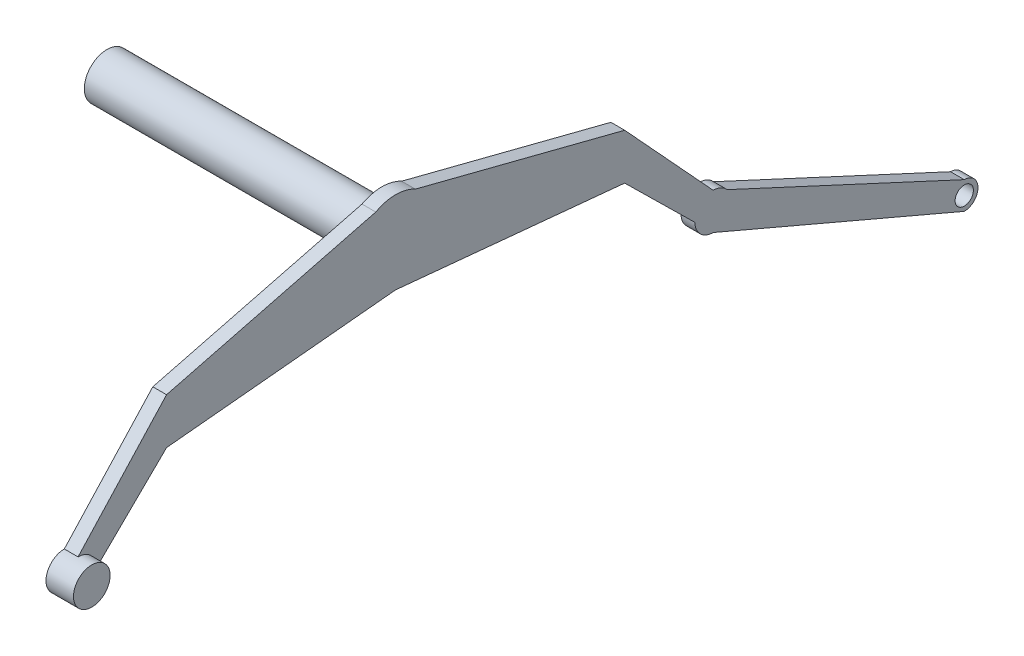
ISO-10303-21;
HEADER;
FILE_DESCRIPTION(('STEP AP214'),'2;1');
FILE_NAME('part.step','',(''),(''),'','','');
FILE_SCHEMA(('AUTOMOTIVE_DESIGN { 1 0 10303 214 1 1 1 1 }'));
ENDSEC;
DATA;
#1=APPLICATION_CONTEXT('core data for automotive mechanical design processes');
#2=APPLICATION_PROTOCOL_DEFINITION('international standard','automotive_design',2000,#1);
#3=PRODUCT_CONTEXT('',#1,'mechanical');
#4=PRODUCT('Part','Part','',(#3));
#5=PRODUCT_RELATED_PRODUCT_CATEGORY('part','',(#4));
#6=PRODUCT_DEFINITION_FORMATION('','',#4);
#7=PRODUCT_DEFINITION_CONTEXT('part definition',#1,'design');
#8=PRODUCT_DEFINITION('design','',#6,#7);
#9=PRODUCT_DEFINITION_SHAPE('','',#8);
#10=(LENGTH_UNIT() NAMED_UNIT(*) SI_UNIT(.MILLI.,.METRE.));
#11=(NAMED_UNIT(*) PLANE_ANGLE_UNIT() SI_UNIT($,.RADIAN.));
#12=(NAMED_UNIT(*) SI_UNIT($,.STERADIAN.) SOLID_ANGLE_UNIT());
#13=UNCERTAINTY_MEASURE_WITH_UNIT(LENGTH_MEASURE(1.E-05),#10,'distance_accuracy_value','');
#14=(GEOMETRIC_REPRESENTATION_CONTEXT(3) GLOBAL_UNCERTAINTY_ASSIGNED_CONTEXT((#13)) GLOBAL_UNIT_ASSIGNED_CONTEXT((#10,
#11,#12)) REPRESENTATION_CONTEXT('',''));
#15=CARTESIAN_POINT('',(0.,0.,0.));
#16=DIRECTION('',(0.,0.,1.));
#17=DIRECTION('',(1.,0.,0.));
#18=AXIS2_PLACEMENT_3D('',#15,#16,#17);
#19=CARTESIAN_POINT('',(30.,179.753290641171,176.832982389412));
#20=DIRECTION('',(0.,0.71287381552973,0.701292323594152));
#21=DIRECTION('',(0.,-0.701292323594152,0.71287381552973));
#22=AXIS2_PLACEMENT_3D('',#19,#20,#21);
#23=PLANE('',#22);
#24=DIRECTION('',(0.,0.701292323594152,-0.71287381552973));
#25=VECTOR('',#24,1.);
#26=CARTESIAN_POINT('',(0.,179.753290641171,176.832982389412));
#27=LINE('',#26,#25);
#28=CARTESIAN_POINT('',(0.,-288.818616503664,653.143120199633));
#29=VERTEX_POINT('',#28);
#30=CARTESIAN_POINT('',(0.,-138.163490354231,500.));
#31=VERTEX_POINT('',#30);
#32=EDGE_CURVE('E251',#29,#31,#27,.T.);
#33=ORIENTED_EDGE('',*,*,#32,.T.);
#34=DIRECTION('',(-1.,0.,0.));
#35=VECTOR('',#34,1.);
#36=CARTESIAN_POINT('',(30.,-138.163490354231,500.));
#37=LINE('',#36,#35);
#38=CARTESIAN_POINT('',(30.,-138.163490354231,500.));
#39=VERTEX_POINT('',#38);
#40=EDGE_CURVE('E417',#39,#31,#37,.T.);
#41=ORIENTED_EDGE('',*,*,#40,.F.);
#42=DIRECTION('',(0.,0.701292323594152,-0.71287381552973));
#43=VECTOR('',#42,1.);
#44=CARTESIAN_POINT('',(30.,179.753290641171,176.832982389412));
#45=LINE('',#44,#43);
#46=CARTESIAN_POINT('',(30.,-288.818616503664,653.143120199633));
#47=VERTEX_POINT('',#46);
#48=EDGE_CURVE('E377',#47,#39,#45,.T.);
#49=ORIENTED_EDGE('',*,*,#48,.F.);
#50=DIRECTION('',(-1.,0.,0.));
#51=VECTOR('',#50,1.);
#52=CARTESIAN_POINT('',(30.,-288.818616503664,653.143120199633));
#53=LINE('',#52,#51);
#54=EDGE_CURVE('E153',#47,#29,#53,.T.);
#55=ORIENTED_EDGE('',*,*,#54,.T.);
#56=EDGE_LOOP('',(#33,#41,#49,#55));
#57=FACE_BOUND('',#56,.T.);
#58=ADVANCED_FACE('F143',(#57),#23,.F.);
#59=CARTESIAN_POINT('',(30.,-89.1725777089985,-8.58972517269854));
#60=DIRECTION('',(0.,0.995392595405889,0.0958831633350092));
#61=DIRECTION('',(0.,-0.0958831633350092,0.995392595405889));
#62=AXIS2_PLACEMENT_3D('',#59,#60,#61);
#63=PLANE('',#62);
#64=DIRECTION('',(0.,0.0958831633350092,-0.995392595405889));
#65=VECTOR('',#64,1.);
#66=CARTESIAN_POINT('',(0.,-89.1725777089985,-8.58972517269854));
#67=LINE('',#66,#65);
#68=CARTESIAN_POINT('',(0.,-90.,0.));
#69=VERTEX_POINT('',#68);
#70=EDGE_CURVE('E396',#31,#69,#67,.T.);
#71=ORIENTED_EDGE('',*,*,#70,.T.);
#72=DIRECTION('',(-1.,0.,0.));
#73=VECTOR('',#72,1.);
#74=CARTESIAN_POINT('',(30.,-90.,0.));
#75=LINE('',#74,#73);
#76=CARTESIAN_POINT('',(30.,-90.,0.));
#77=VERTEX_POINT('',#76);
#78=EDGE_CURVE('E414',#77,#69,#75,.T.);
#79=ORIENTED_EDGE('',*,*,#78,.F.);
#80=DIRECTION('',(0.,0.0958831633350092,-0.995392595405889));
#81=VECTOR('',#80,1.);
#82=CARTESIAN_POINT('',(30.,-89.1725777089985,-8.58972517269854));
#83=LINE('',#82,#81);
#84=EDGE_CURVE('E381',#39,#77,#83,.T.);
#85=ORIENTED_EDGE('',*,*,#84,.F.);
#86=ORIENTED_EDGE('',*,*,#40,.T.);
#87=EDGE_LOOP('',(#71,#79,#85,#86));
#88=FACE_BOUND('',#87,.T.);
#89=ADVANCED_FACE('F469',(#88),#63,.F.);
#90=CARTESIAN_POINT('',(30.,84.4512551785935,21.6471352569688));
#91=DIRECTION('',(0.,0.968683271127436,0.248299658150892));
#92=DIRECTION('',(0.,-0.248299658150892,0.968683271127436));
#93=AXIS2_PLACEMENT_3D('',#90,#91,#92);
#94=PLANE('',#93);
#95=DIRECTION('',(0.,0.248299658150892,-0.968683271127436));
#96=VECTOR('',#95,1.);
#97=CARTESIAN_POINT('',(0.,84.4512551785935,21.6471352569688));
#98=LINE('',#97,#96);
#99=CARTESIAN_POINT('',(0.,-38.163490354231,500.));
#100=VERTEX_POINT('',#99);
#101=CARTESIAN_POINT('',(0.,78.9025103571871,43.2942705139374));
#102=VERTEX_POINT('',#101);
#103=EDGE_CURVE('E400',#100,#102,#98,.T.);
#104=ORIENTED_EDGE('',*,*,#103,.F.);
#105=DIRECTION('',(-1.,0.,0.));
#106=VECTOR('',#105,1.);
#107=CARTESIAN_POINT('',(30.,-38.163490354231,500.));
#108=LINE('',#107,#106);
#109=CARTESIAN_POINT('',(30.,-38.163490354231,500.));
#110=VERTEX_POINT('',#109);
#111=EDGE_CURVE('E161',#110,#100,#108,.T.);
#112=ORIENTED_EDGE('',*,*,#111,.F.);
#113=DIRECTION('',(0.,0.248299658150892,-0.968683271127436));
#114=VECTOR('',#113,1.);
#115=CARTESIAN_POINT('',(30.,84.4512551785935,21.6471352569688));
#116=LINE('',#115,#114);
#117=CARTESIAN_POINT('',(30.,78.9025103571871,43.2942705139374));
#118=VERTEX_POINT('',#117);
#119=EDGE_CURVE('E386',#110,#118,#116,.T.);
#120=ORIENTED_EDGE('',*,*,#119,.T.);
#121=DIRECTION('',(-1.,0.,0.));
#122=VECTOR('',#121,1.);
#123=CARTESIAN_POINT('',(30.,78.9025103571871,43.2942705139374));
#124=LINE('',#123,#122);
#125=EDGE_CURVE('E411',#118,#102,#124,.T.);
#126=ORIENTED_EDGE('',*,*,#125,.T.);
#127=EDGE_LOOP('',(#104,#112,#120,#126));
#128=FACE_BOUND('',#127,.T.);
#129=ADVANCED_FACE('F455',(#128),#94,.T.);
#130=CARTESIAN_POINT('',(30.,231.63850822012,251.862131958318));
#131=DIRECTION('',(0.,0.676938364701913,0.736039707077478));
#132=DIRECTION('',(0.,-0.736039707077478,0.676938364701913));
#133=AXIS2_PLACEMENT_3D('',#130,#131,#132);
#134=PLANE('',#133);
#135=DIRECTION('',(0.,0.736039707077478,-0.676938364701913));
#136=VECTOR('',#135,1.);
#137=CARTESIAN_POINT('',(0.,231.63850822012,251.862131958318));
#138=LINE('',#137,#136);
#139=CARTESIAN_POINT('',(0.,-248.163490354231,693.137754961415));
#140=VERTEX_POINT('',#139);
#141=EDGE_CURVE('E382',#140,#100,#138,.T.);
#142=ORIENTED_EDGE('',*,*,#141,.F.);
#143=DIRECTION('',(-1.,0.,0.));
#144=VECTOR('',#143,1.);
#145=CARTESIAN_POINT('',(30.,-248.163490354231,693.137754961415));
#146=LINE('',#145,#144);
#147=CARTESIAN_POINT('',(30.,-248.163490354231,693.137754961415));
#148=VERTEX_POINT('',#147);
#149=EDGE_CURVE('E393',#148,#140,#146,.T.);
#150=ORIENTED_EDGE('',*,*,#149,.F.);
#151=DIRECTION('',(0.,0.736039707077478,-0.676938364701913));
#152=VECTOR('',#151,1.);
#153=CARTESIAN_POINT('',(30.,231.63850822012,251.862131958318));
#154=LINE('',#153,#152);
#155=EDGE_CURVE('E389',#148,#110,#154,.T.);
#156=ORIENTED_EDGE('',*,*,#155,.T.);
#157=ORIENTED_EDGE('',*,*,#111,.T.);
#158=EDGE_LOOP('',(#142,#150,#156,#157));
#159=FACE_BOUND('',#158,.T.);
#160=ADVANCED_FACE('F460',(#159),#134,.T.);
#161=CARTESIAN_POINT('',(0.,0.,0.));
#162=DIRECTION('',(1.,0.,0.));
#163=DIRECTION('',(0.,0.,-1.));
#164=AXIS2_PLACEMENT_3D('',#161,#162,#163);
#165=PLANE('',#164);
#166=CARTESIAN_POINT('',(0.,0.,0.));
#167=DIRECTION('',(1.,0.,0.));
#168=DIRECTION('',(0.,0.,-1.));
#169=AXIS2_PLACEMENT_3D('',#166,#167,#168);
#170=CIRCLE('',#169,49.5);
#171=CARTESIAN_POINT('',(0.,0.,-49.5));
#172=VERTEX_POINT('',#171);
#173=EDGE_CURVE('E373',#172,#172,#170,.T.);
#174=ORIENTED_EDGE('',*,*,#173,.T.);
#175=EDGE_LOOP('',(#174));
#176=FACE_BOUND('',#175,.T.);
#177=ORIENTED_EDGE('',*,*,#32,.F.);
#178=CARTESIAN_POINT('',(0.,-288.163490354231,693.137754961415));
#179=DIRECTION('',(1.,0.,0.));
#180=DIRECTION('',(0.,0.,-1.));
#181=AXIS2_PLACEMENT_3D('',#178,#179,#180);
#182=CIRCLE('',#181,40.);
#183=EDGE_CURVE('E357',#140,#29,#182,.T.);
#184=ORIENTED_EDGE('',*,*,#183,.F.);
#185=ORIENTED_EDGE('',*,*,#141,.T.);
#186=ORIENTED_EDGE('',*,*,#103,.T.);
#187=CARTESIAN_POINT('',(0.,0.,0.));
#188=DIRECTION('',(1.,0.,0.));
#189=DIRECTION('',(0.,0.,-1.));
#190=AXIS2_PLACEMENT_3D('',#187,#188,#189);
#191=CIRCLE('',#190,90.);
#192=CARTESIAN_POINT('',(0.,78.9025103571871,-43.2942705139374));
#193=VERTEX_POINT('',#192);
#194=EDGE_CURVE('E353',#193,#102,#191,.T.);
#195=ORIENTED_EDGE('',*,*,#194,.F.);
#196=DIRECTION('',(0.,0.248299658150892,0.968683271127436));
#197=VECTOR('',#196,1.);
#198=CARTESIAN_POINT('',(0.,84.4512551785935,-21.6471352569688));
#199=LINE('',#198,#197);
#200=CARTESIAN_POINT('',(0.,-38.1634903542311,-500.));
#201=VERTEX_POINT('',#200);
#202=EDGE_CURVE('E311',#201,#193,#199,.T.);
#203=ORIENTED_EDGE('',*,*,#202,.F.);
#204=DIRECTION('',(0.,0.736039707077478,0.676938364701913));
#205=VECTOR('',#204,1.);
#206=CARTESIAN_POINT('',(0.,231.63850822012,-251.862131958318));
#207=LINE('',#206,#205);
#208=CARTESIAN_POINT('',(0.,-248.163490354231,-693.137754961415));
#209=VERTEX_POINT('',#208);
#210=EDGE_CURVE('E308',#209,#201,#207,.T.);
#211=ORIENTED_EDGE('',*,*,#210,.F.);
#212=CARTESIAN_POINT('',(0.,-288.163490354231,-693.137754961415));
#213=DIRECTION('',(-1.,0.,0.));
#214=DIRECTION('',(0.,0.,1.));
#215=AXIS2_PLACEMENT_3D('',#212,#213,#214);
#216=CIRCLE('',#215,40.);
#217=CARTESIAN_POINT('',(0.,-262.309408733146,-723.659328700826));
#218=VERTEX_POINT('',#217);
#219=EDGE_CURVE('E261',#209,#218,#216,.T.);
#220=ORIENTED_EDGE('',*,*,#219,.T.);
#221=DIRECTION('',(0.,-0.420504434859421,-0.907290482846348));
#222=VECTOR('',#221,1.);
#223=CARTESIAN_POINT('',(0.,60.1634543807957,-27.8841229594067));
#224=LINE('',#223,#222);
#225=CARTESIAN_POINT('',(0.,-502.203490354231,-1241.260569265));
#226=VERTEX_POINT('',#225);
#227=EDGE_CURVE('E249',#218,#226,#224,.T.);
#228=ORIENTED_EDGE('',*,*,#227,.T.);
#229=CARTESIAN_POINT('',(0.,-532.203490354231,-1241.260569265));
#230=DIRECTION('',(1.,0.,0.));
#231=DIRECTION('',(0.,0.,-1.));
#232=AXIS2_PLACEMENT_3D('',#229,#230,#231);
#233=CIRCLE('',#232,30.0000000000001);
#234=CARTESIAN_POINT('',(0.,-562.203490354231,-1241.260569265));
#235=VERTEX_POINT('',#234);
#236=EDGE_CURVE('E302',#235,#226,#233,.T.);
#237=ORIENTED_EDGE('',*,*,#236,.F.);
#238=DIRECTION('',(0.,-0.392686033415235,-0.919672593459547));
#239=VECTOR('',#238,1.);
#240=CARTESIAN_POINT('',(0.,-27.2383594872311,11.6303599996856));
#241=LINE('',#240,#239);
#242=CARTESIAN_POINT('',(0.,-328.163490354231,-693.137754961415));
#243=VERTEX_POINT('',#242);
#244=EDGE_CURVE('E299',#243,#235,#241,.T.);
#245=ORIENTED_EDGE('',*,*,#244,.F.);
#246=CARTESIAN_POINT('',(0.,-288.163490354231,-693.137754961415));
#247=DIRECTION('',(1.,0.,0.));
#248=DIRECTION('',(0.,0.,-1.));
#249=AXIS2_PLACEMENT_3D('',#246,#247,#248);
#250=CIRCLE('',#249,40.);
#251=CARTESIAN_POINT('',(0.,-288.818616503664,-653.143120199633));
#252=VERTEX_POINT('',#251);
#253=EDGE_CURVE('E295',#243,#252,#250,.F.);
#254=ORIENTED_EDGE('',*,*,#253,.T.);
#255=DIRECTION('',(0.,0.701292323594151,0.712873815529731));
#256=VECTOR('',#255,1.);
#257=CARTESIAN_POINT('',(0.,179.753290641171,-176.832982389411));
#258=LINE('',#257,#256);
#259=CARTESIAN_POINT('',(0.,-138.163490354231,-500.));
#260=VERTEX_POINT('',#259);
#261=EDGE_CURVE('E260',#252,#260,#258,.T.);
#262=ORIENTED_EDGE('',*,*,#261,.T.);
#263=DIRECTION('',(0.,0.0958831633350092,0.995392595405889));
#264=VECTOR('',#263,1.);
#265=CARTESIAN_POINT('',(0.,-89.1725777089985,8.58972517269854));
#266=LINE('',#265,#264);
#267=EDGE_CURVE('E315',#260,#69,#266,.T.);
#268=ORIENTED_EDGE('',*,*,#267,.T.);
#269=ORIENTED_EDGE('',*,*,#70,.F.);
#270=EDGE_LOOP('',(#177,#184,#185,#186,#195,#203,#211,#220,#228,#237,#245,#254,#262,#268,#269));
#271=FACE_BOUND('',#270,.T.);
#272=CARTESIAN_POINT('',(0.,-532.203490354231,-1241.260569265));
#273=DIRECTION('',(1.,0.,0.));
#274=DIRECTION('',(0.,0.,-1.));
#275=AXIS2_PLACEMENT_3D('',#272,#273,#274);
#276=CIRCLE('',#275,20.);
#277=CARTESIAN_POINT('',(0.,-532.203490354231,-1261.260569265));
#278=VERTEX_POINT('',#277);
#279=EDGE_CURVE('E319',#278,#278,#276,.T.);
#280=ORIENTED_EDGE('',*,*,#279,.T.);
#281=EDGE_LOOP('',(#280));
#282=FACE_BOUND('',#281,.T.);
#283=ADVANCED_FACE('F441',(#176,#271,#282),#165,.F.);
#284=CARTESIAN_POINT('',(30.,0.,0.));
#285=DIRECTION('',(1.,0.,0.));
#286=DIRECTION('',(0.,0.,-1.));
#287=AXIS2_PLACEMENT_3D('',#284,#285,#286);
#288=PLANE('',#287);
#289=ORIENTED_EDGE('',*,*,#155,.F.);
#290=CARTESIAN_POINT('',(30.,-288.163490354231,693.137754961415));
#291=DIRECTION('',(1.,0.,0.));
#292=DIRECTION('',(0.,0.,-1.));
#293=AXIS2_PLACEMENT_3D('',#290,#291,#292);
#294=CIRCLE('',#293,40.);
#295=EDGE_CURVE('E12',#148,#47,#294,.F.);
#296=ORIENTED_EDGE('',*,*,#295,.T.);
#297=ORIENTED_EDGE('',*,*,#48,.T.);
#298=ORIENTED_EDGE('',*,*,#84,.T.);
#299=DIRECTION('',(0.,0.0958831633350092,0.995392595405889));
#300=VECTOR('',#299,1.);
#301=CARTESIAN_POINT('',(30.,-89.1725777089985,8.58972517269854));
#302=LINE('',#301,#300);
#303=CARTESIAN_POINT('',(30.,-138.163490354231,-500.));
#304=VERTEX_POINT('',#303);
#305=EDGE_CURVE('E283',#304,#77,#302,.T.);
#306=ORIENTED_EDGE('',*,*,#305,.F.);
#307=DIRECTION('',(0.,0.701292323594151,0.712873815529731));
#308=VECTOR('',#307,1.);
#309=CARTESIAN_POINT('',(30.,179.753290641171,-176.832982389411));
#310=LINE('',#309,#308);
#311=CARTESIAN_POINT('',(30.,-288.818616503664,-653.143120199633));
#312=VERTEX_POINT('',#311);
#313=EDGE_CURVE('E323',#312,#304,#310,.T.);
#314=ORIENTED_EDGE('',*,*,#313,.F.);
#315=CARTESIAN_POINT('',(30.,-288.163490354231,-693.137754961415));
#316=DIRECTION('',(1.,0.,0.));
#317=DIRECTION('',(0.,0.,-1.));
#318=AXIS2_PLACEMENT_3D('',#315,#316,#317);
#319=CIRCLE('',#318,40.);
#320=CARTESIAN_POINT('',(30.,-328.163490354231,-693.137754961415));
#321=VERTEX_POINT('',#320);
#322=EDGE_CURVE('E426',#321,#312,#319,.F.);
#323=ORIENTED_EDGE('',*,*,#322,.F.);
#324=DIRECTION('',(0.,-0.392686033415235,-0.919672593459547));
#325=VECTOR('',#324,1.);
#326=CARTESIAN_POINT('',(30.,-27.2383594872311,11.6303599996856));
#327=LINE('',#326,#325);
#328=CARTESIAN_POINT('',(30.,-562.203490354231,-1241.260569265));
#329=VERTEX_POINT('',#328);
#330=EDGE_CURVE('E276',#321,#329,#327,.T.);
#331=ORIENTED_EDGE('',*,*,#330,.T.);
#332=CARTESIAN_POINT('',(30.,-532.203490354231,-1241.260569265));
#333=DIRECTION('',(1.,0.,0.));
#334=DIRECTION('',(0.,0.,-1.));
#335=AXIS2_PLACEMENT_3D('',#332,#333,#334);
#336=CIRCLE('',#335,30.0000000000001);
#337=CARTESIAN_POINT('',(30.,-502.203490354231,-1241.260569265));
#338=VERTEX_POINT('',#337);
#339=EDGE_CURVE('E267',#329,#338,#336,.T.);
#340=ORIENTED_EDGE('',*,*,#339,.T.);
#341=DIRECTION('',(0.,-0.420504434859421,-0.907290482846348));
#342=VECTOR('',#341,1.);
#343=CARTESIAN_POINT('',(30.,60.1634543807957,-27.8841229594067));
#344=LINE('',#343,#342);
#345=CARTESIAN_POINT('',(30.,-262.309408733146,-723.659328700826));
#346=VERTEX_POINT('',#345);
#347=EDGE_CURVE('E247',#346,#338,#344,.T.);
#348=ORIENTED_EDGE('',*,*,#347,.F.);
#349=CARTESIAN_POINT('',(30.,-288.163490354231,-693.137754961415));
#350=DIRECTION('',(-1.,0.,0.));
#351=DIRECTION('',(0.,0.,1.));
#352=AXIS2_PLACEMENT_3D('',#349,#350,#351);
#353=CIRCLE('',#352,40.);
#354=CARTESIAN_POINT('',(30.,-248.163490354231,-693.137754961415));
#355=VERTEX_POINT('',#354);
#356=EDGE_CURVE('E254',#355,#346,#353,.T.);
#357=ORIENTED_EDGE('',*,*,#356,.F.);
#358=DIRECTION('',(0.,0.736039707077478,0.676938364701913));
#359=VECTOR('',#358,1.);
#360=CARTESIAN_POINT('',(30.,231.63850822012,-251.862131958318));
#361=LINE('',#360,#359);
#362=CARTESIAN_POINT('',(30.,-38.1634903542311,-500.));
#363=VERTEX_POINT('',#362);
#364=EDGE_CURVE('E270',#355,#363,#361,.T.);
#365=ORIENTED_EDGE('',*,*,#364,.T.);
#366=DIRECTION('',(0.,0.248299658150892,0.968683271127436));
#367=VECTOR('',#366,1.);
#368=CARTESIAN_POINT('',(30.,84.4512551785935,-21.6471352569688));
#369=LINE('',#368,#367);
#370=CARTESIAN_POINT('',(30.,78.9025103571871,-43.2942705139374));
#371=VERTEX_POINT('',#370);
#372=EDGE_CURVE('E274',#363,#371,#369,.T.);
#373=ORIENTED_EDGE('',*,*,#372,.T.);
#374=CARTESIAN_POINT('',(30.,0.,0.));
#375=DIRECTION('',(1.,0.,0.));
#376=DIRECTION('',(0.,0.,-1.));
#377=AXIS2_PLACEMENT_3D('',#374,#375,#376);
#378=CIRCLE('',#377,90.);
#379=EDGE_CURVE('E349',#371,#118,#378,.T.);
#380=ORIENTED_EDGE('',*,*,#379,.T.);
#381=ORIENTED_EDGE('',*,*,#119,.F.);
#382=EDGE_LOOP('',(#289,#296,#297,#298,#306,#314,#323,#331,#340,#348,#357,#365,#373,#380,#381));
#383=FACE_BOUND('',#382,.T.);
#384=CARTESIAN_POINT('',(30.,-532.203490354231,-1241.260569265));
#385=DIRECTION('',(1.,0.,0.));
#386=DIRECTION('',(0.,0.,-1.));
#387=AXIS2_PLACEMENT_3D('',#384,#385,#386);
#388=CIRCLE('',#387,20.);
#389=CARTESIAN_POINT('',(30.,-532.203490354231,-1261.260569265));
#390=VERTEX_POINT('',#389);
#391=EDGE_CURVE('E287',#390,#390,#388,.T.);
#392=ORIENTED_EDGE('',*,*,#391,.F.);
#393=EDGE_LOOP('',(#392));
#394=FACE_BOUND('',#393,.T.);
#395=ADVANCED_FACE('F264',(#383,#394),#288,.T.);
#396=CARTESIAN_POINT('',(30.,-288.163490354231,693.137754961415));
#397=DIRECTION('',(-1.,0.,0.));
#398=DIRECTION('',(0.,0.,1.));
#399=AXIS2_PLACEMENT_3D('',#396,#397,#398);
#400=CYLINDRICAL_SURFACE('',#399,40.);
#401=ORIENTED_EDGE('',*,*,#183,.T.);
#402=ORIENTED_EDGE('',*,*,#54,.F.);
#403=ORIENTED_EDGE('',*,*,#295,.F.);
#404=ORIENTED_EDGE('',*,*,#149,.T.);
#405=EDGE_LOOP('',(#401,#402,#403,#404));
#406=FACE_BOUND('',#405,.T.);
#407=CARTESIAN_POINT('',(60.,-288.163490354231,693.137754961415));
#408=DIRECTION('',(1.,0.,0.));
#409=DIRECTION('',(0.,0.,-1.));
#410=AXIS2_PLACEMENT_3D('',#407,#408,#409);
#411=CIRCLE('',#410,40.);
#412=CARTESIAN_POINT('',(60.,-288.163490354231,653.137754961415));
#413=VERTEX_POINT('',#412);
#414=EDGE_CURVE('E360',#413,#413,#411,.T.);
#415=ORIENTED_EDGE('',*,*,#414,.F.);
#416=EDGE_LOOP('',(#415));
#417=FACE_BOUND('',#416,.T.);
#418=ADVANCED_FACE('F145',(#406,#417),#400,.T.);
#419=CARTESIAN_POINT('',(30.,-532.203490354231,-1241.260569265));
#420=DIRECTION('',(-1.,0.,0.));
#421=DIRECTION('',(0.,0.,1.));
#422=AXIS2_PLACEMENT_3D('',#419,#420,#421);
#423=CYLINDRICAL_SURFACE('',#422,30.0000000000001);
#424=ORIENTED_EDGE('',*,*,#236,.T.);
#425=DIRECTION('',(-1.,0.,0.));
#426=VECTOR('',#425,1.);
#427=CARTESIAN_POINT('',(30.,-502.203490354231,-1241.260569265));
#428=LINE('',#427,#426);
#429=EDGE_CURVE('E335',#338,#226,#428,.T.);
#430=ORIENTED_EDGE('',*,*,#429,.F.);
#431=ORIENTED_EDGE('',*,*,#339,.F.);
#432=DIRECTION('',(-1.,0.,0.));
#433=VECTOR('',#432,1.);
#434=CARTESIAN_POINT('',(30.,-562.203490354231,-1241.260569265));
#435=LINE('',#434,#433);
#436=EDGE_CURVE('E338',#329,#235,#435,.T.);
#437=ORIENTED_EDGE('',*,*,#436,.T.);
#438=EDGE_LOOP('',(#424,#430,#431,#437));
#439=FACE_BOUND('',#438,.T.);
#440=ADVANCED_FACE('F439',(#439),#423,.T.);
#441=CARTESIAN_POINT('',(30.,60.1634543807957,-27.8841229594067));
#442=DIRECTION('',(0.,0.907290482846348,-0.420504434859421));
#443=DIRECTION('',(0.,0.420504434859421,0.907290482846348));
#444=AXIS2_PLACEMENT_3D('',#441,#442,#443);
#445=PLANE('',#444);
#446=DIRECTION('',(-1.,0.,0.));
#447=VECTOR('',#446,1.);
#448=CARTESIAN_POINT('',(30.,-262.309408733146,-723.659328700826));
#449=LINE('',#448,#447);
#450=EDGE_CURVE('E240',#346,#218,#449,.T.);
#451=ORIENTED_EDGE('',*,*,#450,.F.);
#452=ORIENTED_EDGE('',*,*,#347,.T.);
#453=ORIENTED_EDGE('',*,*,#429,.T.);
#454=ORIENTED_EDGE('',*,*,#227,.F.);
#455=EDGE_LOOP('',(#451,#452,#453,#454));
#456=FACE_BOUND('',#455,.T.);
#457=ADVANCED_FACE('F244',(#456),#445,.T.);
#458=CARTESIAN_POINT('',(30.,-532.203490354231,-1241.260569265));
#459=DIRECTION('',(-1.,0.,0.));
#460=DIRECTION('',(0.,0.,1.));
#461=AXIS2_PLACEMENT_3D('',#458,#459,#460);
#462=CYLINDRICAL_SURFACE('',#461,20.);
#463=ORIENTED_EDGE('',*,*,#391,.T.);
#464=EDGE_LOOP('',(#463));
#465=FACE_BOUND('',#464,.T.);
#466=ORIENTED_EDGE('',*,*,#279,.F.);
#467=EDGE_LOOP('',(#466));
#468=FACE_BOUND('',#467,.T.);
#469=ADVANCED_FACE('F492',(#465,#468),#462,.F.);
#470=CARTESIAN_POINT('',(30.,-27.2383594872311,11.6303599996856));
#471=DIRECTION('',(0.,0.919672593459547,-0.392686033415235));
#472=DIRECTION('',(0.,0.392686033415235,0.919672593459547));
#473=AXIS2_PLACEMENT_3D('',#470,#471,#472);
#474=PLANE('',#473);
#475=ORIENTED_EDGE('',*,*,#244,.T.);
#476=ORIENTED_EDGE('',*,*,#436,.F.);
#477=ORIENTED_EDGE('',*,*,#330,.F.);
#478=DIRECTION('',(-1.,0.,0.));
#479=VECTOR('',#478,1.);
#480=CARTESIAN_POINT('',(30.,-328.163490354231,-693.137754961415));
#481=LINE('',#480,#479);
#482=EDGE_CURVE('E342',#321,#243,#481,.T.);
#483=ORIENTED_EDGE('',*,*,#482,.T.);
#484=EDGE_LOOP('',(#475,#476,#477,#483));
#485=FACE_BOUND('',#484,.T.);
#486=ADVANCED_FACE('F435',(#485),#474,.F.);
#487=CARTESIAN_POINT('',(30.,-288.163490354231,-693.137754961415));
#488=DIRECTION('',(-1.,0.,0.));
#489=DIRECTION('',(0.,0.,1.));
#490=AXIS2_PLACEMENT_3D('',#487,#488,#489);
#491=CYLINDRICAL_SURFACE('',#490,40.);
#492=ORIENTED_EDGE('',*,*,#356,.T.);
#493=ORIENTED_EDGE('',*,*,#450,.T.);
#494=ORIENTED_EDGE('',*,*,#219,.F.);
#495=DIRECTION('',(-1.,0.,0.));
#496=VECTOR('',#495,1.);
#497=CARTESIAN_POINT('',(30.,-248.163490354231,-693.137754961415));
#498=LINE('',#497,#496);
#499=EDGE_CURVE('E256',#355,#209,#498,.T.);
#500=ORIENTED_EDGE('',*,*,#499,.F.);
#501=EDGE_LOOP('',(#492,#493,#494,#500));
#502=FACE_BOUND('',#501,.T.);
#503=ADVANCED_FACE('F255',(#502),#491,.T.);
#504=CARTESIAN_POINT('',(30.,-288.163490354231,-693.137754961415));
#505=DIRECTION('',(-1.,0.,0.));
#506=DIRECTION('',(0.,0.,1.));
#507=AXIS2_PLACEMENT_3D('',#504,#505,#506);
#508=CYLINDRICAL_SURFACE('',#507,40.);
#509=ORIENTED_EDGE('',*,*,#253,.F.);
#510=ORIENTED_EDGE('',*,*,#482,.F.);
#511=ORIENTED_EDGE('',*,*,#322,.T.);
#512=DIRECTION('',(-1.,0.,0.));
#513=VECTOR('',#512,1.);
#514=CARTESIAN_POINT('',(30.,-288.818616503664,-653.143120199633));
#515=LINE('',#514,#513);
#516=EDGE_CURVE('E252',#312,#252,#515,.T.);
#517=ORIENTED_EDGE('',*,*,#516,.T.);
#518=EDGE_LOOP('',(#509,#510,#511,#517));
#519=FACE_BOUND('',#518,.T.);
#520=ADVANCED_FACE('F482',(#519),#508,.T.);
#521=CARTESIAN_POINT('',(30.,231.63850822012,-251.862131958318));
#522=DIRECTION('',(0.,-0.676938364701913,0.736039707077478));
#523=DIRECTION('',(0.,-0.736039707077478,-0.676938364701913));
#524=AXIS2_PLACEMENT_3D('',#521,#522,#523);
#525=PLANE('',#524);
#526=ORIENTED_EDGE('',*,*,#210,.T.);
#527=DIRECTION('',(-1.,0.,0.));
#528=VECTOR('',#527,1.);
#529=CARTESIAN_POINT('',(30.,-38.1634903542311,-500.));
#530=LINE('',#529,#528);
#531=EDGE_CURVE('E329',#363,#201,#530,.T.);
#532=ORIENTED_EDGE('',*,*,#531,.F.);
#533=ORIENTED_EDGE('',*,*,#364,.F.);
#534=ORIENTED_EDGE('',*,*,#499,.T.);
#535=EDGE_LOOP('',(#526,#532,#533,#534));
#536=FACE_BOUND('',#535,.T.);
#537=ADVANCED_FACE('F449',(#536),#525,.F.);
#538=CARTESIAN_POINT('',(30.,179.753290641171,-176.832982389411));
#539=DIRECTION('',(0.,-0.712873815529731,0.701292323594151));
#540=DIRECTION('',(0.,-0.701292323594151,-0.712873815529731));
#541=AXIS2_PLACEMENT_3D('',#538,#539,#540);
#542=PLANE('',#541);
#543=ORIENTED_EDGE('',*,*,#261,.F.);
#544=ORIENTED_EDGE('',*,*,#516,.F.);
#545=ORIENTED_EDGE('',*,*,#313,.T.);
#546=DIRECTION('',(-1.,0.,0.));
#547=VECTOR('',#546,1.);
#548=CARTESIAN_POINT('',(30.,-138.163490354231,-500.));
#549=LINE('',#548,#547);
#550=EDGE_CURVE('E291',#304,#260,#549,.T.);
#551=ORIENTED_EDGE('',*,*,#550,.T.);
#552=EDGE_LOOP('',(#543,#544,#545,#551));
#553=FACE_BOUND('',#552,.T.);
#554=ADVANCED_FACE('F480',(#553),#542,.T.);
#555=CARTESIAN_POINT('',(30.,84.4512551785935,-21.6471352569688));
#556=DIRECTION('',(0.,-0.968683271127436,0.248299658150892));
#557=DIRECTION('',(0.,-0.248299658150892,-0.968683271127436));
#558=AXIS2_PLACEMENT_3D('',#555,#556,#557);
#559=PLANE('',#558);
#560=ORIENTED_EDGE('',*,*,#202,.T.);
#561=DIRECTION('',(-1.,0.,0.));
#562=VECTOR('',#561,1.);
#563=CARTESIAN_POINT('',(30.,78.9025103571871,-43.2942705139374));
#564=LINE('',#563,#562);
#565=EDGE_CURVE('E326',#371,#193,#564,.T.);
#566=ORIENTED_EDGE('',*,*,#565,.F.);
#567=ORIENTED_EDGE('',*,*,#372,.F.);
#568=ORIENTED_EDGE('',*,*,#531,.T.);
#569=EDGE_LOOP('',(#560,#566,#567,#568));
#570=FACE_BOUND('',#569,.T.);
#571=ADVANCED_FACE('F452',(#570),#559,.F.);
#572=CARTESIAN_POINT('',(30.,0.,0.));
#573=DIRECTION('',(-1.,0.,0.));
#574=DIRECTION('',(0.,0.,1.));
#575=AXIS2_PLACEMENT_3D('',#572,#573,#574);
#576=CYLINDRICAL_SURFACE('',#575,90.);
#577=ORIENTED_EDGE('',*,*,#125,.F.);
#578=ORIENTED_EDGE('',*,*,#379,.F.);
#579=ORIENTED_EDGE('',*,*,#565,.T.);
#580=ORIENTED_EDGE('',*,*,#194,.T.);
#581=EDGE_LOOP('',(#577,#578,#579,#580));
#582=FACE_BOUND('',#581,.T.);
#583=ADVANCED_FACE('F456',(#582),#576,.T.);
#584=CARTESIAN_POINT('',(30.,-89.1725777089985,8.58972517269854));
#585=DIRECTION('',(0.,-0.995392595405889,0.0958831633350092));
#586=DIRECTION('',(0.,-0.0958831633350092,-0.995392595405889));
#587=AXIS2_PLACEMENT_3D('',#584,#585,#586);
#588=PLANE('',#587);
#589=ORIENTED_EDGE('',*,*,#267,.F.);
#590=ORIENTED_EDGE('',*,*,#550,.F.);
#591=ORIENTED_EDGE('',*,*,#305,.T.);
#592=ORIENTED_EDGE('',*,*,#78,.T.);
#593=EDGE_LOOP('',(#589,#590,#591,#592));
#594=FACE_BOUND('',#593,.T.);
#595=ADVANCED_FACE('F474',(#594),#588,.T.);
#596=CARTESIAN_POINT('',(60.,0.,0.));
#597=DIRECTION('',(1.,0.,0.));
#598=DIRECTION('',(0.,0.,-1.));
#599=AXIS2_PLACEMENT_3D('',#596,#597,#598);
#600=PLANE('',#599);
#601=ORIENTED_EDGE('',*,*,#414,.T.);
#602=EDGE_LOOP('',(#601));
#603=FACE_BOUND('',#602,.T.);
#604=ADVANCED_FACE('F491',(#603),#600,.T.);
#605=CARTESIAN_POINT('',(-600.,0.,0.));
#606=DIRECTION('',(1.,0.,0.));
#607=DIRECTION('',(0.,0.,-1.));
#608=AXIS2_PLACEMENT_3D('',#605,#606,#607);
#609=CYLINDRICAL_SURFACE('',#608,49.5);
#610=CARTESIAN_POINT('',(-600.,0.,0.));
#611=DIRECTION('',(1.,0.,0.));
#612=DIRECTION('',(0.,0.,-1.));
#613=AXIS2_PLACEMENT_3D('',#610,#611,#612);
#614=CIRCLE('',#613,49.5);
#615=CARTESIAN_POINT('',(-600.,0.,-49.5));
#616=VERTEX_POINT('',#615);
#617=EDGE_CURVE('E367',#616,#616,#614,.T.);
#618=ORIENTED_EDGE('',*,*,#617,.T.);
#619=EDGE_LOOP('',(#618));
#620=FACE_BOUND('',#619,.T.);
#621=ORIENTED_EDGE('',*,*,#173,.F.);
#622=EDGE_LOOP('',(#621));
#623=FACE_BOUND('',#622,.T.);
#624=ADVANCED_FACE('F555',(#620,#623),#609,.T.);
#625=CARTESIAN_POINT('',(-600.,0.,0.));
#626=DIRECTION('',(1.,0.,0.));
#627=DIRECTION('',(0.,0.,-1.));
#628=AXIS2_PLACEMENT_3D('',#625,#626,#627);
#629=PLANE('',#628);
#630=ORIENTED_EDGE('',*,*,#617,.F.);
#631=EDGE_LOOP('',(#630));
#632=FACE_BOUND('',#631,.T.);
#633=ADVANCED_FACE('F560',(#632),#629,.F.);
#634=CLOSED_SHELL('',(#58,#89,#129,#160,#283,#395,#418,#440,#457,#469,#486,#503,#520,#537,#554,
#571,#583,#595,#604,#624,#633));
#635=MANIFOLD_SOLID_BREP('B2',#634);
#636=ADVANCED_BREP_SHAPE_REPRESENTATION('',(#18,#635),#14);
#637=SHAPE_DEFINITION_REPRESENTATION(#9,#636);
ENDSEC;
END-ISO-10303-21;
